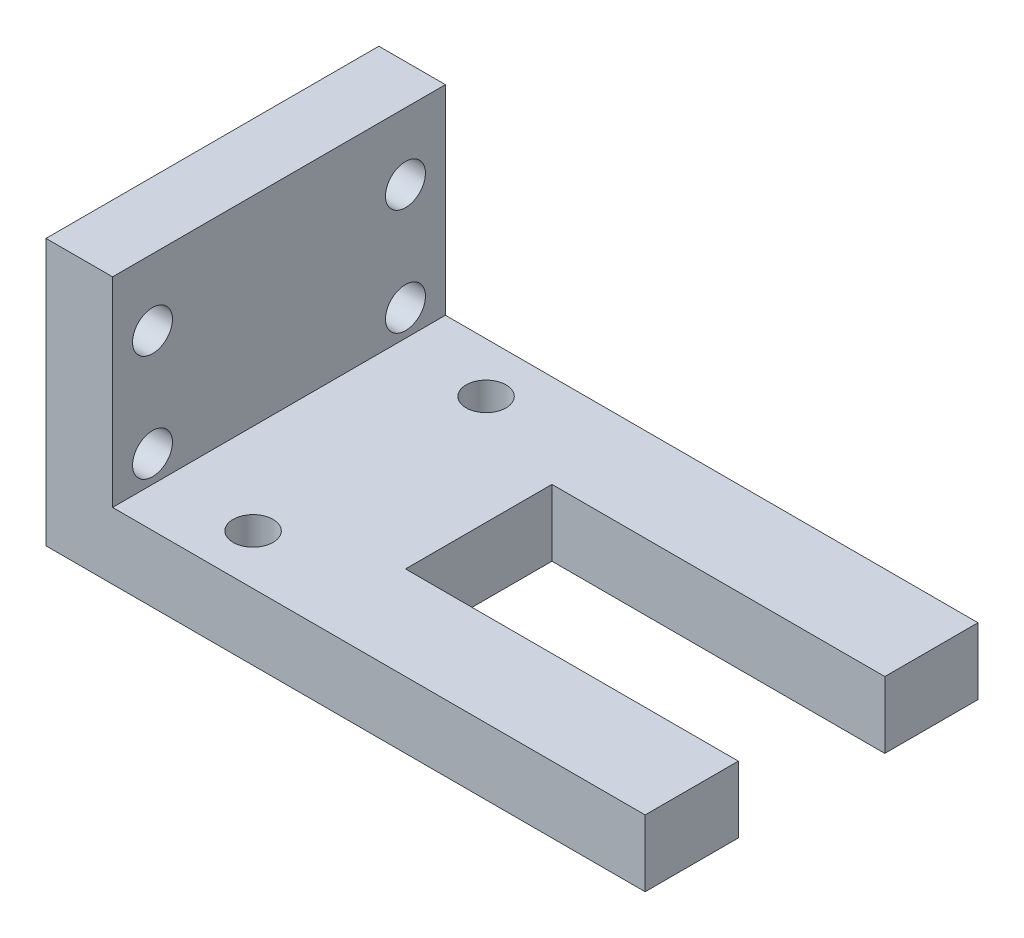
ISO-10303-21;
HEADER;
FILE_DESCRIPTION(('STEP AP214'),'2;1');
FILE_NAME('part.step','',(''),(''),'','','');
FILE_SCHEMA(('AUTOMOTIVE_DESIGN { 1 0 10303 214 1 1 1 1 }'));
ENDSEC;
DATA;
#1=APPLICATION_CONTEXT('core data for automotive mechanical design processes');
#2=APPLICATION_PROTOCOL_DEFINITION('international standard','automotive_design',2000,#1);
#3=PRODUCT_CONTEXT('',#1,'mechanical');
#4=PRODUCT('Part','Part','',(#3));
#5=PRODUCT_RELATED_PRODUCT_CATEGORY('part','',(#4));
#6=PRODUCT_DEFINITION_FORMATION('','',#4);
#7=PRODUCT_DEFINITION_CONTEXT('part definition',#1,'design');
#8=PRODUCT_DEFINITION('design','',#6,#7);
#9=PRODUCT_DEFINITION_SHAPE('','',#8);
#10=(LENGTH_UNIT() NAMED_UNIT(*) SI_UNIT(.MILLI.,.METRE.));
#11=(NAMED_UNIT(*) PLANE_ANGLE_UNIT() SI_UNIT($,.RADIAN.));
#12=(NAMED_UNIT(*) SI_UNIT($,.STERADIAN.) SOLID_ANGLE_UNIT());
#13=UNCERTAINTY_MEASURE_WITH_UNIT(LENGTH_MEASURE(1.E-05),#10,'distance_accuracy_value','');
#14=(GEOMETRIC_REPRESENTATION_CONTEXT(3) GLOBAL_UNCERTAINTY_ASSIGNED_CONTEXT((#13)) GLOBAL_UNIT_ASSIGNED_CONTEXT((#10,
#11,#12)) REPRESENTATION_CONTEXT('',''));
#15=CARTESIAN_POINT('',(0.,0.,0.));
#16=DIRECTION('',(0.,0.,1.));
#17=DIRECTION('',(1.,0.,0.));
#18=AXIS2_PLACEMENT_3D('',#15,#16,#17);
#19=CARTESIAN_POINT('',(40.,12.9310344827586,-25.));
#20=DIRECTION('',(1.,0.,0.));
#21=DIRECTION('',(0.,0.,-1.));
#22=AXIS2_PLACEMENT_3D('',#19,#20,#21);
#23=PLANE('',#22);
#24=DIRECTION('',(0.,-1.,0.));
#25=VECTOR('',#24,1.);
#26=CARTESIAN_POINT('',(40.,57.9310344827586,-18.));
#27=LINE('',#26,#25);
#28=CARTESIAN_POINT('',(40.,12.9310344827586,-18.));
#29=VERTEX_POINT('',#28);
#30=CARTESIAN_POINT('',(40.,7.93103448275862,-18.));
#31=VERTEX_POINT('',#30);
#32=EDGE_CURVE('E235',#29,#31,#27,.T.);
#33=ORIENTED_EDGE('',*,*,#32,.T.);
#34=DIRECTION('',(0.,0.,1.));
#35=VECTOR('',#34,1.);
#36=CARTESIAN_POINT('',(40.,7.93103448275862,-25.));
#37=LINE('',#36,#35);
#38=CARTESIAN_POINT('',(40.,7.93103448275862,-25.));
#39=VERTEX_POINT('',#38);
#40=EDGE_CURVE('E129',#39,#31,#37,.T.);
#41=ORIENTED_EDGE('',*,*,#40,.F.);
#42=DIRECTION('',(0.,1.,0.));
#43=VECTOR('',#42,1.);
#44=CARTESIAN_POINT('',(40.,12.9310344827586,-25.));
#45=LINE('',#44,#43);
#46=CARTESIAN_POINT('',(40.,12.9310344827586,-25.));
#47=VERTEX_POINT('',#46);
#48=EDGE_CURVE('E123',#39,#47,#45,.T.);
#49=ORIENTED_EDGE('',*,*,#48,.T.);
#50=DIRECTION('',(0.,0.,1.));
#51=VECTOR('',#50,1.);
#52=CARTESIAN_POINT('',(40.,12.9310344827586,-25.));
#53=LINE('',#52,#51);
#54=EDGE_CURVE('E102',#47,#29,#53,.T.);
#55=ORIENTED_EDGE('',*,*,#54,.T.);
#56=EDGE_LOOP('',(#33,#41,#49,#55));
#57=FACE_BOUND('',#56,.T.);
#58=ADVANCED_FACE('F38',(#57),#23,.T.);
#59=CARTESIAN_POINT('',(-5.,27.9310344827586,-25.));
#60=DIRECTION('',(0.,1.,0.));
#61=DIRECTION('',(0.,0.,1.));
#62=AXIS2_PLACEMENT_3D('',#59,#60,#61);
#63=PLANE('',#62);
#64=DIRECTION('',(-1.,0.,0.));
#65=VECTOR('',#64,1.);
#66=CARTESIAN_POINT('',(-5.,27.9310344827586,0.));
#67=LINE('',#66,#65);
#68=CARTESIAN_POINT('',(0.,27.9310344827586,0.));
#69=VERTEX_POINT('',#68);
#70=CARTESIAN_POINT('',(-5.,27.9310344827586,0.));
#71=VERTEX_POINT('',#70);
#72=EDGE_CURVE('E140',#69,#71,#67,.T.);
#73=ORIENTED_EDGE('',*,*,#72,.F.);
#74=DIRECTION('',(0.,0.,1.));
#75=VECTOR('',#74,1.);
#76=CARTESIAN_POINT('',(0.,27.9310344827586,-25.));
#77=LINE('',#76,#75);
#78=CARTESIAN_POINT('',(0.,27.9310344827586,-25.));
#79=VERTEX_POINT('',#78);
#80=EDGE_CURVE('E11',#79,#69,#77,.T.);
#81=ORIENTED_EDGE('',*,*,#80,.F.);
#82=DIRECTION('',(-1.,0.,0.));
#83=VECTOR('',#82,1.);
#84=CARTESIAN_POINT('',(-5.,27.9310344827586,-25.));
#85=LINE('',#84,#83);
#86=CARTESIAN_POINT('',(-5.,27.9310344827586,-25.));
#87=VERTEX_POINT('',#86);
#88=EDGE_CURVE('E163',#79,#87,#85,.T.);
#89=ORIENTED_EDGE('',*,*,#88,.T.);
#90=DIRECTION('',(0.,0.,1.));
#91=VECTOR('',#90,1.);
#92=CARTESIAN_POINT('',(-5.,27.9310344827586,-25.));
#93=LINE('',#92,#91);
#94=EDGE_CURVE('E42',#87,#71,#93,.T.);
#95=ORIENTED_EDGE('',*,*,#94,.T.);
#96=EDGE_LOOP('',(#73,#81,#89,#95));
#97=FACE_BOUND('',#96,.T.);
#98=ADVANCED_FACE('F40',(#97),#63,.T.);
#99=CARTESIAN_POINT('',(0.,27.9310344827586,-25.));
#100=DIRECTION('',(1.,0.,0.));
#101=DIRECTION('',(0.,1.,0.));
#102=AXIS2_PLACEMENT_3D('',#99,#100,#101);
#103=PLANE('',#102);
#104=CARTESIAN_POINT('',(0.,14.9310344827586,-22.));
#105=DIRECTION('',(1.,0.,0.));
#106=DIRECTION('',(0.,1.,0.));
#107=AXIS2_PLACEMENT_3D('',#104,#105,#106);
#108=CIRCLE('',#107,1.5);
#109=CARTESIAN_POINT('',(0.,16.4310344827586,-22.));
#110=VERTEX_POINT('',#109);
#111=EDGE_CURVE('E145',#110,#110,#108,.T.);
#112=ORIENTED_EDGE('',*,*,#111,.F.);
#113=EDGE_LOOP('',(#112));
#114=FACE_BOUND('',#113,.T.);
#115=CARTESIAN_POINT('',(0.,14.9310344827586,-3.));
#116=DIRECTION('',(1.,0.,0.));
#117=DIRECTION('',(0.,1.,0.));
#118=AXIS2_PLACEMENT_3D('',#115,#116,#117);
#119=CIRCLE('',#118,1.5);
#120=CARTESIAN_POINT('',(0.,16.4310344827586,-3.));
#121=VERTEX_POINT('',#120);
#122=EDGE_CURVE('E300',#121,#121,#119,.T.);
#123=ORIENTED_EDGE('',*,*,#122,.F.);
#124=EDGE_LOOP('',(#123));
#125=FACE_BOUND('',#124,.T.);
#126=CARTESIAN_POINT('',(0.,22.9310344827586,-3.));
#127=DIRECTION('',(1.,0.,0.));
#128=DIRECTION('',(0.,1.,0.));
#129=AXIS2_PLACEMENT_3D('',#126,#127,#128);
#130=CIRCLE('',#129,1.5);
#131=CARTESIAN_POINT('',(0.,24.4310344827586,-3.));
#132=VERTEX_POINT('',#131);
#133=EDGE_CURVE('E296',#132,#132,#130,.T.);
#134=ORIENTED_EDGE('',*,*,#133,.F.);
#135=EDGE_LOOP('',(#134));
#136=FACE_BOUND('',#135,.T.);
#137=CARTESIAN_POINT('',(0.,22.9310344827586,-22.));
#138=DIRECTION('',(1.,0.,0.));
#139=DIRECTION('',(0.,1.,0.));
#140=AXIS2_PLACEMENT_3D('',#137,#138,#139);
#141=CIRCLE('',#140,1.5);
#142=CARTESIAN_POINT('',(0.,24.4310344827586,-22.));
#143=VERTEX_POINT('',#142);
#144=EDGE_CURVE('E292',#143,#143,#141,.T.);
#145=ORIENTED_EDGE('',*,*,#144,.F.);
#146=EDGE_LOOP('',(#145));
#147=FACE_BOUND('',#146,.T.);
#148=DIRECTION('',(0.,1.,0.));
#149=VECTOR('',#148,1.);
#150=CARTESIAN_POINT('',(0.,27.9310344827586,0.));
#151=LINE('',#150,#149);
#152=CARTESIAN_POINT('',(0.,12.9310344827586,0.));
#153=VERTEX_POINT('',#152);
#154=EDGE_CURVE('E160',#153,#69,#151,.T.);
#155=ORIENTED_EDGE('',*,*,#154,.F.);
#156=DIRECTION('',(0.,0.,1.));
#157=VECTOR('',#156,1.);
#158=CARTESIAN_POINT('',(0.,12.9310344827586,-25.));
#159=LINE('',#158,#157);
#160=CARTESIAN_POINT('',(0.,12.9310344827586,-25.));
#161=VERTEX_POINT('',#160);
#162=EDGE_CURVE('E49',#161,#153,#159,.T.);
#163=ORIENTED_EDGE('',*,*,#162,.F.);
#164=DIRECTION('',(0.,1.,0.));
#165=VECTOR('',#164,1.);
#166=CARTESIAN_POINT('',(0.,27.9310344827586,-25.));
#167=LINE('',#166,#165);
#168=EDGE_CURVE('E125',#161,#79,#167,.T.);
#169=ORIENTED_EDGE('',*,*,#168,.T.);
#170=ORIENTED_EDGE('',*,*,#80,.T.);
#171=EDGE_LOOP('',(#155,#163,#169,#170));
#172=FACE_BOUND('',#171,.T.);
#173=ADVANCED_FACE('F177',(#114,#125,#136,#147,#172),#103,.T.);
#174=CARTESIAN_POINT('',(0.,12.9310344827586,-25.));
#175=DIRECTION('',(0.,1.,0.));
#176=DIRECTION('',(0.,0.,1.));
#177=AXIS2_PLACEMENT_3D('',#174,#175,#176);
#178=PLANE('',#177);
#179=DIRECTION('',(1.,0.,0.));
#180=VECTOR('',#179,1.);
#181=CARTESIAN_POINT('',(0.,12.9310344827586,-7.));
#182=LINE('',#181,#180);
#183=CARTESIAN_POINT('',(15.,12.9310344827586,-7.));
#184=VERTEX_POINT('',#183);
#185=CARTESIAN_POINT('',(40.,12.9310344827586,-7.));
#186=VERTEX_POINT('',#185);
#187=EDGE_CURVE('E223',#184,#186,#182,.T.);
#188=ORIENTED_EDGE('',*,*,#187,.F.);
#189=DIRECTION('',(0.,0.,1.));
#190=VECTOR('',#189,1.);
#191=CARTESIAN_POINT('',(15.,12.9310344827586,-25.));
#192=LINE('',#191,#190);
#193=CARTESIAN_POINT('',(15.,12.9310344827586,-18.));
#194=VERTEX_POINT('',#193);
#195=EDGE_CURVE('E258',#194,#184,#192,.T.);
#196=ORIENTED_EDGE('',*,*,#195,.F.);
#197=DIRECTION('',(-1.,0.,0.));
#198=VECTOR('',#197,1.);
#199=CARTESIAN_POINT('',(0.,12.9310344827586,-18.));
#200=LINE('',#199,#198);
#201=EDGE_CURVE('E112',#29,#194,#200,.T.);
#202=ORIENTED_EDGE('',*,*,#201,.F.);
#203=ORIENTED_EDGE('',*,*,#54,.F.);
#204=DIRECTION('',(-1.,0.,0.));
#205=VECTOR('',#204,1.);
#206=CARTESIAN_POINT('',(0.,12.9310344827586,-25.));
#207=LINE('',#206,#205);
#208=EDGE_CURVE('E107',#47,#161,#207,.T.);
#209=ORIENTED_EDGE('',*,*,#208,.T.);
#210=ORIENTED_EDGE('',*,*,#162,.T.);
#211=DIRECTION('',(-1.,0.,0.));
#212=VECTOR('',#211,1.);
#213=CARTESIAN_POINT('',(0.,12.9310344827586,0.));
#214=LINE('',#213,#212);
#215=CARTESIAN_POINT('',(40.,12.9310344827586,0.));
#216=VERTEX_POINT('',#215);
#217=EDGE_CURVE('E157',#216,#153,#214,.T.);
#218=ORIENTED_EDGE('',*,*,#217,.F.);
#219=EDGE_CURVE('E117',#186,#216,#53,.T.);
#220=ORIENTED_EDGE('',*,*,#219,.F.);
#221=EDGE_LOOP('',(#188,#196,#202,#203,#209,#210,#218,#220));
#222=FACE_BOUND('',#221,.T.);
#223=CARTESIAN_POINT('',(6.80203006619647,12.9310344827586,-3.75));
#224=DIRECTION('',(0.,1.,0.));
#225=DIRECTION('',(0.,0.,1.));
#226=AXIS2_PLACEMENT_3D('',#223,#224,#225);
#227=CIRCLE('',#226,1.5);
#228=CARTESIAN_POINT('',(6.80203006619647,12.9310344827586,-2.25));
#229=VERTEX_POINT('',#228);
#230=EDGE_CURVE('E272',#229,#229,#227,.T.);
#231=ORIENTED_EDGE('',*,*,#230,.F.);
#232=EDGE_LOOP('',(#231));
#233=FACE_BOUND('',#232,.T.);
#234=CARTESIAN_POINT('',(6.80203006619647,12.9310344827586,-21.25));
#235=DIRECTION('',(0.,1.,0.));
#236=DIRECTION('',(0.,0.,1.));
#237=AXIS2_PLACEMENT_3D('',#234,#235,#236);
#238=CIRCLE('',#237,1.5);
#239=CARTESIAN_POINT('',(6.80203006619647,12.9310344827586,-19.75));
#240=VERTEX_POINT('',#239);
#241=EDGE_CURVE('E268',#240,#240,#238,.T.);
#242=ORIENTED_EDGE('',*,*,#241,.F.);
#243=EDGE_LOOP('',(#242));
#244=FACE_BOUND('',#243,.T.);
#245=ADVANCED_FACE('F105',(#222,#233,#244),#178,.T.);
#246=DIRECTION('',(0.,-1.,0.));
#247=VECTOR('',#246,1.);
#248=CARTESIAN_POINT('',(40.,57.9310344827586,-7.));
#249=LINE('',#248,#247);
#250=CARTESIAN_POINT('',(40.,7.93103448275862,-7.));
#251=VERTEX_POINT('',#250);
#252=EDGE_CURVE('E208',#186,#251,#249,.T.);
#253=ORIENTED_EDGE('',*,*,#252,.F.);
#254=ORIENTED_EDGE('',*,*,#219,.T.);
#255=DIRECTION('',(0.,1.,0.));
#256=VECTOR('',#255,1.);
#257=CARTESIAN_POINT('',(40.,12.9310344827586,0.));
#258=LINE('',#257,#256);
#259=CARTESIAN_POINT('',(40.,7.93103448275862,0.));
#260=VERTEX_POINT('',#259);
#261=EDGE_CURVE('E153',#260,#216,#258,.T.);
#262=ORIENTED_EDGE('',*,*,#261,.F.);
#263=EDGE_CURVE('E168',#251,#260,#37,.T.);
#264=ORIENTED_EDGE('',*,*,#263,.F.);
#265=EDGE_LOOP('',(#253,#254,#262,#264));
#266=FACE_BOUND('',#265,.T.);
#267=ADVANCED_FACE('F186',(#266),#23,.T.);
#268=CARTESIAN_POINT('',(40.,7.93103448275862,-25.));
#269=DIRECTION('',(0.,-1.,0.));
#270=DIRECTION('',(1.,0.,0.));
#271=AXIS2_PLACEMENT_3D('',#268,#269,#270);
#272=PLANE('',#271);
#273=DIRECTION('',(0.,0.,-1.));
#274=VECTOR('',#273,1.);
#275=CARTESIAN_POINT('',(15.,7.93103448275862,-8.));
#276=LINE('',#275,#274);
#277=CARTESIAN_POINT('',(15.,7.93103448275862,-7.));
#278=VERTEX_POINT('',#277);
#279=CARTESIAN_POINT('',(15.,7.93103448275862,-18.));
#280=VERTEX_POINT('',#279);
#281=EDGE_CURVE('E229',#278,#280,#276,.T.);
#282=ORIENTED_EDGE('',*,*,#281,.F.);
#283=DIRECTION('',(-1.,0.,0.));
#284=VECTOR('',#283,1.);
#285=CARTESIAN_POINT('',(15.,7.93103448275862,-7.));
#286=LINE('',#285,#284);
#287=EDGE_CURVE('E221',#251,#278,#286,.T.);
#288=ORIENTED_EDGE('',*,*,#287,.F.);
#289=ORIENTED_EDGE('',*,*,#263,.T.);
#290=DIRECTION('',(1.,0.,0.));
#291=VECTOR('',#290,1.);
#292=CARTESIAN_POINT('',(40.,7.93103448275862,0.));
#293=LINE('',#292,#291);
#294=CARTESIAN_POINT('',(-5.,7.93103448275861,0.));
#295=VERTEX_POINT('',#294);
#296=EDGE_CURVE('E149',#295,#260,#293,.T.);
#297=ORIENTED_EDGE('',*,*,#296,.F.);
#298=DIRECTION('',(0.,0.,1.));
#299=VECTOR('',#298,1.);
#300=CARTESIAN_POINT('',(-5.,7.93103448275861,-25.));
#301=LINE('',#300,#299);
#302=CARTESIAN_POINT('',(-5.,7.93103448275861,-25.));
#303=VERTEX_POINT('',#302);
#304=EDGE_CURVE('E169',#303,#295,#301,.T.);
#305=ORIENTED_EDGE('',*,*,#304,.F.);
#306=DIRECTION('',(1.,0.,0.));
#307=VECTOR('',#306,1.);
#308=CARTESIAN_POINT('',(40.,7.93103448275862,-25.));
#309=LINE('',#308,#307);
#310=EDGE_CURVE('E131',#303,#39,#309,.T.);
#311=ORIENTED_EDGE('',*,*,#310,.T.);
#312=ORIENTED_EDGE('',*,*,#40,.T.);
#313=DIRECTION('',(1.,0.,0.));
#314=VECTOR('',#313,1.);
#315=CARTESIAN_POINT('',(15.,7.93103448275862,-18.));
#316=LINE('',#315,#314);
#317=EDGE_CURVE('E243',#280,#31,#316,.T.);
#318=ORIENTED_EDGE('',*,*,#317,.F.);
#319=EDGE_LOOP('',(#282,#288,#289,#297,#305,#311,#312,#318));
#320=FACE_BOUND('',#319,.T.);
#321=CARTESIAN_POINT('',(6.80203006619647,7.93103448275861,-3.75));
#322=DIRECTION('',(0.,-1.,0.));
#323=DIRECTION('',(1.,0.,0.));
#324=AXIS2_PLACEMENT_3D('',#321,#322,#323);
#325=CIRCLE('',#324,1.5);
#326=CARTESIAN_POINT('',(8.30203006619646,7.93103448275861,-3.75));
#327=VERTEX_POINT('',#326);
#328=EDGE_CURVE('E254',#327,#327,#325,.T.);
#329=ORIENTED_EDGE('',*,*,#328,.F.);
#330=EDGE_LOOP('',(#329));
#331=FACE_BOUND('',#330,.T.);
#332=CARTESIAN_POINT('',(6.80203006619647,7.93103448275861,-21.25));
#333=DIRECTION('',(0.,-1.,0.));
#334=DIRECTION('',(1.,0.,0.));
#335=AXIS2_PLACEMENT_3D('',#332,#333,#334);
#336=CIRCLE('',#335,1.5);
#337=CARTESIAN_POINT('',(8.30203006619647,7.93103448275861,-21.25));
#338=VERTEX_POINT('',#337);
#339=EDGE_CURVE('E259',#338,#338,#336,.T.);
#340=ORIENTED_EDGE('',*,*,#339,.F.);
#341=EDGE_LOOP('',(#340));
#342=FACE_BOUND('',#341,.T.);
#343=ADVANCED_FACE('F198',(#320,#331,#342),#272,.T.);
#344=CARTESIAN_POINT('',(-5.,7.93103448275861,-25.));
#345=DIRECTION('',(-1.,0.,0.));
#346=DIRECTION('',(0.,0.,1.));
#347=AXIS2_PLACEMENT_3D('',#344,#345,#346);
#348=PLANE('',#347);
#349=CARTESIAN_POINT('',(-5.,14.9310344827586,-22.));
#350=DIRECTION('',(-1.,0.,0.));
#351=DIRECTION('',(0.,0.,1.));
#352=AXIS2_PLACEMENT_3D('',#349,#350,#351);
#353=CIRCLE('',#352,1.5);
#354=CARTESIAN_POINT('',(-5.,14.9310344827586,-20.5));
#355=VERTEX_POINT('',#354);
#356=EDGE_CURVE('E276',#355,#355,#353,.T.);
#357=ORIENTED_EDGE('',*,*,#356,.F.);
#358=EDGE_LOOP('',(#357));
#359=FACE_BOUND('',#358,.T.);
#360=CARTESIAN_POINT('',(-5.,14.9310344827586,-3.));
#361=DIRECTION('',(-1.,0.,0.));
#362=DIRECTION('',(0.,0.,1.));
#363=AXIS2_PLACEMENT_3D('',#360,#361,#362);
#364=CIRCLE('',#363,1.5);
#365=CARTESIAN_POINT('',(-5.,14.9310344827586,-1.5));
#366=VERTEX_POINT('',#365);
#367=EDGE_CURVE('E282',#366,#366,#364,.T.);
#368=ORIENTED_EDGE('',*,*,#367,.F.);
#369=EDGE_LOOP('',(#368));
#370=FACE_BOUND('',#369,.T.);
#371=CARTESIAN_POINT('',(-5.,22.9310344827586,-3.));
#372=DIRECTION('',(-1.,0.,0.));
#373=DIRECTION('',(0.,0.,1.));
#374=AXIS2_PLACEMENT_3D('',#371,#372,#373);
#375=CIRCLE('',#374,1.5);
#376=CARTESIAN_POINT('',(-5.,22.9310344827586,-1.5));
#377=VERTEX_POINT('',#376);
#378=EDGE_CURVE('E277',#377,#377,#375,.T.);
#379=ORIENTED_EDGE('',*,*,#378,.F.);
#380=EDGE_LOOP('',(#379));
#381=FACE_BOUND('',#380,.T.);
#382=CARTESIAN_POINT('',(-5.,22.9310344827586,-22.));
#383=DIRECTION('',(-1.,0.,0.));
#384=DIRECTION('',(0.,0.,1.));
#385=AXIS2_PLACEMENT_3D('',#382,#383,#384);
#386=CIRCLE('',#385,1.5);
#387=CARTESIAN_POINT('',(-5.,22.9310344827586,-20.5));
#388=VERTEX_POINT('',#387);
#389=EDGE_CURVE('E281',#388,#388,#386,.T.);
#390=ORIENTED_EDGE('',*,*,#389,.F.);
#391=EDGE_LOOP('',(#390));
#392=FACE_BOUND('',#391,.T.);
#393=DIRECTION('',(0.,-1.,0.));
#394=VECTOR('',#393,1.);
#395=CARTESIAN_POINT('',(-5.,7.93103448275861,0.));
#396=LINE('',#395,#394);
#397=EDGE_CURVE('E144',#71,#295,#396,.T.);
#398=ORIENTED_EDGE('',*,*,#397,.F.);
#399=ORIENTED_EDGE('',*,*,#94,.F.);
#400=DIRECTION('',(0.,-1.,0.));
#401=VECTOR('',#400,1.);
#402=CARTESIAN_POINT('',(-5.,7.93103448275861,-25.));
#403=LINE('',#402,#401);
#404=EDGE_CURVE('E134',#87,#303,#403,.T.);
#405=ORIENTED_EDGE('',*,*,#404,.T.);
#406=ORIENTED_EDGE('',*,*,#304,.T.);
#407=EDGE_LOOP('',(#398,#399,#405,#406));
#408=FACE_BOUND('',#407,.T.);
#409=ADVANCED_FACE('F174',(#359,#370,#381,#392,#408),#348,.T.);
#410=CARTESIAN_POINT('',(0.,0.,-25.));
#411=DIRECTION('',(0.,0.,-1.));
#412=DIRECTION('',(-1.,0.,0.));
#413=AXIS2_PLACEMENT_3D('',#410,#411,#412);
#414=PLANE('',#413);
#415=ORIENTED_EDGE('',*,*,#88,.F.);
#416=ORIENTED_EDGE('',*,*,#168,.F.);
#417=ORIENTED_EDGE('',*,*,#208,.F.);
#418=ORIENTED_EDGE('',*,*,#48,.F.);
#419=ORIENTED_EDGE('',*,*,#310,.F.);
#420=ORIENTED_EDGE('',*,*,#404,.F.);
#421=EDGE_LOOP('',(#415,#416,#417,#418,#419,#420));
#422=FACE_BOUND('',#421,.T.);
#423=ADVANCED_FACE('F121',(#422),#414,.T.);
#424=CARTESIAN_POINT('',(0.,0.,0.));
#425=DIRECTION('',(0.,0.,-1.));
#426=DIRECTION('',(-1.,0.,0.));
#427=AXIS2_PLACEMENT_3D('',#424,#425,#426);
#428=PLANE('',#427);
#429=ORIENTED_EDGE('',*,*,#72,.T.);
#430=ORIENTED_EDGE('',*,*,#397,.T.);
#431=ORIENTED_EDGE('',*,*,#296,.T.);
#432=ORIENTED_EDGE('',*,*,#261,.T.);
#433=ORIENTED_EDGE('',*,*,#217,.T.);
#434=ORIENTED_EDGE('',*,*,#154,.T.);
#435=EDGE_LOOP('',(#429,#430,#431,#432,#433,#434));
#436=FACE_BOUND('',#435,.T.);
#437=ADVANCED_FACE('F176',(#436),#428,.F.);
#438=CARTESIAN_POINT('',(21.,22.9310344827586,-22.));
#439=DIRECTION('',(-1.,0.,0.));
#440=DIRECTION('',(0.,0.,1.));
#441=AXIS2_PLACEMENT_3D('',#438,#439,#440);
#442=CYLINDRICAL_SURFACE('',#441,1.5);
#443=ORIENTED_EDGE('',*,*,#144,.T.);
#444=EDGE_LOOP('',(#443));
#445=FACE_BOUND('',#444,.T.);
#446=ORIENTED_EDGE('',*,*,#389,.T.);
#447=EDGE_LOOP('',(#446));
#448=FACE_BOUND('',#447,.T.);
#449=ADVANCED_FACE('F343',(#445,#448),#442,.F.);
#450=CARTESIAN_POINT('',(21.,22.9310344827586,-3.));
#451=DIRECTION('',(-1.,0.,0.));
#452=DIRECTION('',(0.,0.,1.));
#453=AXIS2_PLACEMENT_3D('',#450,#451,#452);
#454=CYLINDRICAL_SURFACE('',#453,1.5);
#455=ORIENTED_EDGE('',*,*,#133,.T.);
#456=EDGE_LOOP('',(#455));
#457=FACE_BOUND('',#456,.T.);
#458=ORIENTED_EDGE('',*,*,#378,.T.);
#459=EDGE_LOOP('',(#458));
#460=FACE_BOUND('',#459,.T.);
#461=ADVANCED_FACE('F339',(#457,#460),#454,.F.);
#462=CARTESIAN_POINT('',(21.,14.9310344827586,-3.));
#463=DIRECTION('',(-1.,0.,0.));
#464=DIRECTION('',(0.,0.,1.));
#465=AXIS2_PLACEMENT_3D('',#462,#463,#464);
#466=CYLINDRICAL_SURFACE('',#465,1.5);
#467=ORIENTED_EDGE('',*,*,#122,.T.);
#468=EDGE_LOOP('',(#467));
#469=FACE_BOUND('',#468,.T.);
#470=ORIENTED_EDGE('',*,*,#367,.T.);
#471=EDGE_LOOP('',(#470));
#472=FACE_BOUND('',#471,.T.);
#473=ADVANCED_FACE('F342',(#469,#472),#466,.F.);
#474=CARTESIAN_POINT('',(21.,14.9310344827586,-22.));
#475=DIRECTION('',(-1.,0.,0.));
#476=DIRECTION('',(0.,0.,1.));
#477=AXIS2_PLACEMENT_3D('',#474,#475,#476);
#478=CYLINDRICAL_SURFACE('',#477,1.5);
#479=ORIENTED_EDGE('',*,*,#111,.T.);
#480=EDGE_LOOP('',(#479));
#481=FACE_BOUND('',#480,.T.);
#482=ORIENTED_EDGE('',*,*,#356,.T.);
#483=EDGE_LOOP('',(#482));
#484=FACE_BOUND('',#483,.T.);
#485=ADVANCED_FACE('F338',(#481,#484),#478,.F.);
#486=CARTESIAN_POINT('',(15.,17.9310344827586,-8.));
#487=DIRECTION('',(-1.,0.,0.));
#488=DIRECTION('',(0.,0.,1.));
#489=AXIS2_PLACEMENT_3D('',#486,#487,#488);
#490=PLANE('',#489);
#491=ORIENTED_EDGE('',*,*,#195,.T.);
#492=DIRECTION('',(0.,-1.,0.));
#493=VECTOR('',#492,1.);
#494=CARTESIAN_POINT('',(15.,57.9310344827586,-7.));
#495=LINE('',#494,#493);
#496=EDGE_CURVE('E220',#184,#278,#495,.T.);
#497=ORIENTED_EDGE('',*,*,#496,.T.);
#498=ORIENTED_EDGE('',*,*,#281,.T.);
#499=DIRECTION('',(0.,-1.,0.));
#500=VECTOR('',#499,1.);
#501=CARTESIAN_POINT('',(15.,57.9310344827586,-18.));
#502=LINE('',#501,#500);
#503=EDGE_CURVE('E238',#194,#280,#502,.T.);
#504=ORIENTED_EDGE('',*,*,#503,.F.);
#505=EDGE_LOOP('',(#491,#497,#498,#504));
#506=FACE_BOUND('',#505,.T.);
#507=ADVANCED_FACE('F319',(#506),#490,.F.);
#508=CARTESIAN_POINT('',(6.80203006619647,17.9310344827586,-21.25));
#509=DIRECTION('',(0.,-1.,0.));
#510=DIRECTION('',(1.,0.,0.));
#511=AXIS2_PLACEMENT_3D('',#508,#509,#510);
#512=CYLINDRICAL_SURFACE('',#511,1.5);
#513=ORIENTED_EDGE('',*,*,#241,.T.);
#514=EDGE_LOOP('',(#513));
#515=FACE_BOUND('',#514,.T.);
#516=ORIENTED_EDGE('',*,*,#339,.T.);
#517=EDGE_LOOP('',(#516));
#518=FACE_BOUND('',#517,.T.);
#519=ADVANCED_FACE('F329',(#515,#518),#512,.F.);
#520=CARTESIAN_POINT('',(6.80203006619647,17.9310344827586,-3.75));
#521=DIRECTION('',(0.,-1.,0.));
#522=DIRECTION('',(1.,0.,0.));
#523=AXIS2_PLACEMENT_3D('',#520,#521,#522);
#524=CYLINDRICAL_SURFACE('',#523,1.5);
#525=ORIENTED_EDGE('',*,*,#230,.T.);
#526=EDGE_LOOP('',(#525));
#527=FACE_BOUND('',#526,.T.);
#528=ORIENTED_EDGE('',*,*,#328,.T.);
#529=EDGE_LOOP('',(#528));
#530=FACE_BOUND('',#529,.T.);
#531=ADVANCED_FACE('F322',(#527,#530),#524,.F.);
#532=CARTESIAN_POINT('',(15.,57.9310344827586,-7.));
#533=DIRECTION('',(0.,0.,1.));
#534=DIRECTION('',(1.,0.,0.));
#535=AXIS2_PLACEMENT_3D('',#532,#533,#534);
#536=PLANE('',#535);
#537=ORIENTED_EDGE('',*,*,#187,.T.);
#538=ORIENTED_EDGE('',*,*,#252,.T.);
#539=ORIENTED_EDGE('',*,*,#287,.T.);
#540=ORIENTED_EDGE('',*,*,#496,.F.);
#541=EDGE_LOOP('',(#537,#538,#539,#540));
#542=FACE_BOUND('',#541,.T.);
#543=ADVANCED_FACE('F320',(#542),#536,.F.);
#544=CARTESIAN_POINT('',(15.,57.9310344827586,-18.));
#545=DIRECTION('',(0.,0.,-1.));
#546=DIRECTION('',(-1.,0.,0.));
#547=AXIS2_PLACEMENT_3D('',#544,#545,#546);
#548=PLANE('',#547);
#549=ORIENTED_EDGE('',*,*,#201,.T.);
#550=ORIENTED_EDGE('',*,*,#503,.T.);
#551=ORIENTED_EDGE('',*,*,#317,.T.);
#552=ORIENTED_EDGE('',*,*,#32,.F.);
#553=EDGE_LOOP('',(#549,#550,#551,#552));
#554=FACE_BOUND('',#553,.T.);
#555=ADVANCED_FACE('F318',(#554),#548,.F.);
#556=CLOSED_SHELL('',(#58,#98,#173,#245,#267,#343,#409,#423,#437,#449,#461,#473,#485,#507,#519,
#531,#543,#555));
#557=MANIFOLD_SOLID_BREP('B2',#556);
#558=ADVANCED_BREP_SHAPE_REPRESENTATION('',(#18,#557),#14);
#559=SHAPE_DEFINITION_REPRESENTATION(#9,#558);
ENDSEC;
END-ISO-10303-21;
